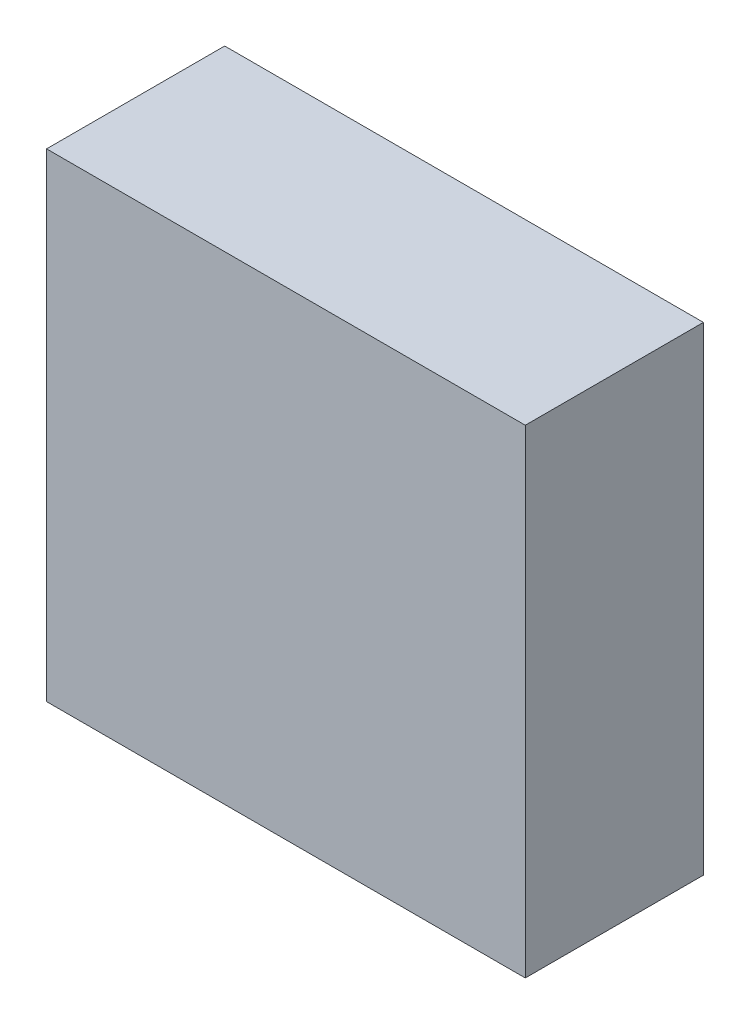
ISO-10303-21;
HEADER;
FILE_DESCRIPTION(('STEP AP214'),'2;1');
FILE_NAME('part.step','',(''),(''),'','','');
FILE_SCHEMA(('AUTOMOTIVE_DESIGN { 1 0 10303 214 1 1 1 1 }'));
ENDSEC;
DATA;
#1=APPLICATION_CONTEXT('core data for automotive mechanical design processes');
#2=APPLICATION_PROTOCOL_DEFINITION('international standard','automotive_design',2000,#1);
#3=PRODUCT_CONTEXT('',#1,'mechanical');
#4=PRODUCT('Part','Part','',(#3));
#5=PRODUCT_RELATED_PRODUCT_CATEGORY('part','',(#4));
#6=PRODUCT_DEFINITION_FORMATION('','',#4);
#7=PRODUCT_DEFINITION_CONTEXT('part definition',#1,'design');
#8=PRODUCT_DEFINITION('design','',#6,#7);
#9=PRODUCT_DEFINITION_SHAPE('','',#8);
#10=(LENGTH_UNIT() NAMED_UNIT(*) SI_UNIT(.MILLI.,.METRE.));
#11=(NAMED_UNIT(*) PLANE_ANGLE_UNIT() SI_UNIT($,.RADIAN.));
#12=(NAMED_UNIT(*) SI_UNIT($,.STERADIAN.) SOLID_ANGLE_UNIT());
#13=UNCERTAINTY_MEASURE_WITH_UNIT(LENGTH_MEASURE(1.E-05),#10,'distance_accuracy_value','');
#14=(GEOMETRIC_REPRESENTATION_CONTEXT(3) GLOBAL_UNCERTAINTY_ASSIGNED_CONTEXT((#13)) GLOBAL_UNIT_ASSIGNED_CONTEXT((#10,
#11,#12)) REPRESENTATION_CONTEXT('',''));
#15=CARTESIAN_POINT('',(0.,0.,0.));
#16=DIRECTION('',(0.,0.,1.));
#17=DIRECTION('',(1.,0.,0.));
#18=AXIS2_PLACEMENT_3D('',#15,#16,#17);
#19=CARTESIAN_POINT('',(-1.07499912,1.07500166,0.80000094));
#20=DIRECTION('',(0.,0.,-1.));
#21=DIRECTION('',(-1.,0.,0.));
#22=AXIS2_PLACEMENT_3D('',#19,#20,#21);
#23=PLANE('',#22);
#24=DIRECTION('',(-0.999999999999302,1.18139771023536E-06,0.));
#25=VECTOR('',#24,1.);
#26=CARTESIAN_POINT('',(-1.07499658,-1.07499658,0.80000094));
#27=LINE('',#26,#25);
#28=CARTESIAN_POINT('',(-1.07499658,-1.07499785,0.80000094));
#29=VERTEX_POINT('',#28);
#30=CARTESIAN_POINT('',(1.07499785,-1.07499912,0.80000094));
#31=VERTEX_POINT('',#30);
#32=EDGE_CURVE('E55',#29,#31,#27,.F.);
#33=ORIENTED_EDGE('',*,*,#32,.T.);
#34=DIRECTION('',(1.18139631784136E-06,-0.999999999999302,0.));
#35=VECTOR('',#34,1.);
#36=CARTESIAN_POINT('',(1.07499912,-1.07499912,0.80000094));
#37=LINE('',#36,#35);
#38=CARTESIAN_POINT('',(1.07499658,1.07500039,0.80000094));
#39=VERTEX_POINT('',#38);
#40=EDGE_CURVE('E57',#31,#39,#37,.F.);
#41=ORIENTED_EDGE('',*,*,#40,.T.);
#42=DIRECTION('',(0.999999999999302,-1.18139771023536E-06,0.));
#43=VECTOR('',#42,1.);
#44=CARTESIAN_POINT('',(1.07499658,1.07499912,0.80000094));
#45=LINE('',#44,#43);
#46=CARTESIAN_POINT('',(-1.074998485,1.07500166,0.80000094));
#47=VERTEX_POINT('',#46);
#48=EDGE_CURVE('E20',#39,#47,#45,.F.);
#49=ORIENTED_EDGE('',*,*,#48,.T.);
#50=DIRECTION('',(-1.18139631453636E-06,0.999999999999302,0.));
#51=VECTOR('',#50,1.);
#52=CARTESIAN_POINT('',(-1.07499912,1.07500166,0.80000094));
#53=LINE('',#52,#51);
#54=EDGE_CURVE('E80',#47,#29,#53,.F.);
#55=ORIENTED_EDGE('',*,*,#54,.T.);
#56=EDGE_LOOP('',(#33,#41,#49,#55));
#57=FACE_BOUND('',#56,.T.);
#58=ADVANCED_FACE('F17',(#57),#23,.F.);
#59=CARTESIAN_POINT('',(1.07499658,1.07499912,0.));
#60=DIRECTION('',(-1.18139771023536E-06,-0.999999999999302,0.));
#61=DIRECTION('',(0.999999999999302,-1.18139771023536E-06,0.));
#62=AXIS2_PLACEMENT_3D('',#59,#60,#61);
#63=PLANE('',#62);
#64=DIRECTION('',(0.,0.,1.));
#65=VECTOR('',#64,1.);
#66=CARTESIAN_POINT('',(-1.07499912,1.07500166,0.));
#67=LINE('',#66,#65);
#68=CARTESIAN_POINT('',(-1.074998485,1.07500166,0.));
#69=VERTEX_POINT('',#68);
#70=EDGE_CURVE('E68',#69,#47,#67,.T.);
#71=ORIENTED_EDGE('',*,*,#70,.T.);
#72=ORIENTED_EDGE('',*,*,#48,.F.);
#73=DIRECTION('',(0.,0.,1.));
#74=VECTOR('',#73,1.);
#75=CARTESIAN_POINT('',(1.07499658,1.07499912,0.));
#76=LINE('',#75,#74);
#77=CARTESIAN_POINT('',(1.07499658,1.074999755,0.));
#78=VERTEX_POINT('',#77);
#79=EDGE_CURVE('E63',#39,#78,#76,.F.);
#80=ORIENTED_EDGE('',*,*,#79,.T.);
#81=DIRECTION('',(-1.,0.,0.));
#82=VECTOR('',#81,1.);
#83=CARTESIAN_POINT('',(-1.07499912,1.07500166,0.));
#84=LINE('',#83,#82);
#85=EDGE_CURVE('E83',#69,#78,#84,.F.);
#86=ORIENTED_EDGE('',*,*,#85,.F.);
#87=EDGE_LOOP('',(#71,#72,#80,#86));
#88=FACE_BOUND('',#87,.T.);
#89=ADVANCED_FACE('F65',(#88),#63,.F.);
#90=CARTESIAN_POINT('',(1.07499912,-1.07499912,0.));
#91=DIRECTION('',(-0.999999999999302,-1.18139631784136E-06,0.));
#92=DIRECTION('',(1.18139631784136E-06,-0.999999999999302,0.));
#93=AXIS2_PLACEMENT_3D('',#90,#91,#92);
#94=PLANE('',#93);
#95=ORIENTED_EDGE('',*,*,#79,.F.);
#96=ORIENTED_EDGE('',*,*,#40,.F.);
#97=DIRECTION('',(0.,0.,1.));
#98=VECTOR('',#97,1.);
#99=CARTESIAN_POINT('',(1.07499912,-1.07499912,0.));
#100=LINE('',#99,#98);
#101=CARTESIAN_POINT('',(1.074998485,-1.07499912,0.));
#102=VERTEX_POINT('',#101);
#103=EDGE_CURVE('E75',#31,#102,#100,.F.);
#104=ORIENTED_EDGE('',*,*,#103,.T.);
#105=DIRECTION('',(0.,1.,0.));
#106=VECTOR('',#105,1.);
#107=CARTESIAN_POINT('',(1.07499658,1.07500166,0.));
#108=LINE('',#107,#106);
#109=EDGE_CURVE('E72',#78,#102,#108,.F.);
#110=ORIENTED_EDGE('',*,*,#109,.F.);
#111=EDGE_LOOP('',(#95,#96,#104,#110));
#112=FACE_BOUND('',#111,.T.);
#113=ADVANCED_FACE('F70',(#112),#94,.F.);
#114=CARTESIAN_POINT('',(-1.07499658,-1.07499658,0.));
#115=DIRECTION('',(1.18139771023536E-06,0.999999999999302,0.));
#116=DIRECTION('',(-0.999999999999302,1.18139771023536E-06,0.));
#117=AXIS2_PLACEMENT_3D('',#114,#115,#116);
#118=PLANE('',#117);
#119=ORIENTED_EDGE('',*,*,#103,.F.);
#120=ORIENTED_EDGE('',*,*,#32,.F.);
#121=DIRECTION('',(0.,0.,1.));
#122=VECTOR('',#121,1.);
#123=CARTESIAN_POINT('',(-1.07499658,-1.07499658,0.));
#124=LINE('',#123,#122);
#125=CARTESIAN_POINT('',(-1.07499658,-1.074997215,0.));
#126=VERTEX_POINT('',#125);
#127=EDGE_CURVE('E35',#29,#126,#124,.F.);
#128=ORIENTED_EDGE('',*,*,#127,.T.);
#129=DIRECTION('',(-1.,0.,0.));
#130=VECTOR('',#129,1.);
#131=CARTESIAN_POINT('',(-1.07499912,-1.07499912,0.));
#132=LINE('',#131,#130);
#133=EDGE_CURVE('E26',#102,#126,#132,.T.);
#134=ORIENTED_EDGE('',*,*,#133,.F.);
#135=EDGE_LOOP('',(#119,#120,#128,#134));
#136=FACE_BOUND('',#135,.T.);
#137=ADVANCED_FACE('F89',(#136),#118,.F.);
#138=CARTESIAN_POINT('',(-1.07499912,1.07500166,0.));
#139=DIRECTION('',(0.999999999999302,1.18139631453636E-06,0.));
#140=DIRECTION('',(-1.18139631453636E-06,0.999999999999302,0.));
#141=AXIS2_PLACEMENT_3D('',#138,#139,#140);
#142=PLANE('',#141);
#143=ORIENTED_EDGE('',*,*,#127,.F.);
#144=ORIENTED_EDGE('',*,*,#54,.F.);
#145=ORIENTED_EDGE('',*,*,#70,.F.);
#146=DIRECTION('',(0.,1.,0.));
#147=VECTOR('',#146,1.);
#148=CARTESIAN_POINT('',(-1.07499658,1.07500166,0.));
#149=LINE('',#148,#147);
#150=EDGE_CURVE('E11',#126,#69,#149,.T.);
#151=ORIENTED_EDGE('',*,*,#150,.F.);
#152=EDGE_LOOP('',(#143,#144,#145,#151));
#153=FACE_BOUND('',#152,.T.);
#154=ADVANCED_FACE('F91',(#153),#142,.F.);
#155=CARTESIAN_POINT('',(-1.07499912,1.07500166,0.));
#156=DIRECTION('',(0.,0.,-1.));
#157=DIRECTION('',(-1.,0.,0.));
#158=AXIS2_PLACEMENT_3D('',#155,#156,#157);
#159=PLANE('',#158);
#160=ORIENTED_EDGE('',*,*,#133,.T.);
#161=ORIENTED_EDGE('',*,*,#150,.T.);
#162=ORIENTED_EDGE('',*,*,#85,.T.);
#163=ORIENTED_EDGE('',*,*,#109,.T.);
#164=EDGE_LOOP('',(#160,#161,#162,#163));
#165=FACE_BOUND('',#164,.T.);
#166=ADVANCED_FACE('F88',(#165),#159,.T.);
#167=CLOSED_SHELL('',(#58,#89,#113,#137,#154,#166));
#168=MANIFOLD_SOLID_BREP('B1',#167);
#169=ADVANCED_BREP_SHAPE_REPRESENTATION('',(#18,#168),#14);
#170=SHAPE_DEFINITION_REPRESENTATION(#9,#169);
ENDSEC;
END-ISO-10303-21;
